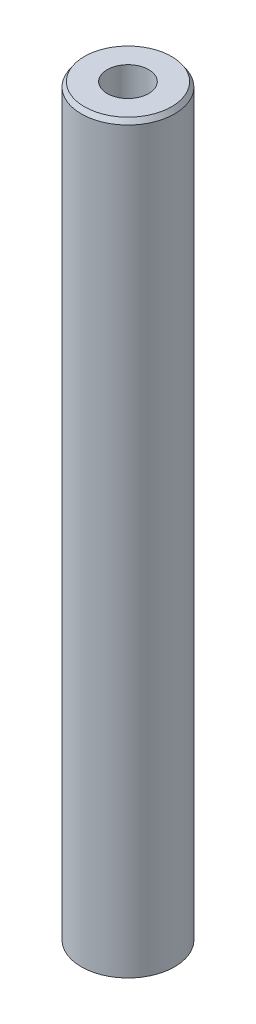
ISO-10303-21;
HEADER;
FILE_DESCRIPTION(('STEP AP214'),'2;1');
FILE_NAME('part.step','',(''),(''),'','','');
FILE_SCHEMA(('AUTOMOTIVE_DESIGN { 1 0 10303 214 1 1 1 1 }'));
ENDSEC;
DATA;
#1=APPLICATION_CONTEXT('core data for automotive mechanical design processes');
#2=APPLICATION_PROTOCOL_DEFINITION('international standard','automotive_design',2000,#1);
#3=PRODUCT_CONTEXT('',#1,'mechanical');
#4=PRODUCT('Part','Part','',(#3));
#5=PRODUCT_RELATED_PRODUCT_CATEGORY('part','',(#4));
#6=PRODUCT_DEFINITION_FORMATION('','',#4);
#7=PRODUCT_DEFINITION_CONTEXT('part definition',#1,'design');
#8=PRODUCT_DEFINITION('design','',#6,#7);
#9=PRODUCT_DEFINITION_SHAPE('','',#8);
#10=(LENGTH_UNIT() NAMED_UNIT(*) SI_UNIT(.MILLI.,.METRE.));
#11=(NAMED_UNIT(*) PLANE_ANGLE_UNIT() SI_UNIT($,.RADIAN.));
#12=(NAMED_UNIT(*) SI_UNIT($,.STERADIAN.) SOLID_ANGLE_UNIT());
#13=UNCERTAINTY_MEASURE_WITH_UNIT(LENGTH_MEASURE(1.E-05),#10,'distance_accuracy_value','');
#14=(GEOMETRIC_REPRESENTATION_CONTEXT(3) GLOBAL_UNCERTAINTY_ASSIGNED_CONTEXT((#13)) GLOBAL_UNIT_ASSIGNED_CONTEXT((#10,
#11,#12)) REPRESENTATION_CONTEXT('',''));
#15=CARTESIAN_POINT('',(0.,0.,0.));
#16=DIRECTION('',(0.,0.,1.));
#17=DIRECTION('',(1.,0.,0.));
#18=AXIS2_PLACEMENT_3D('',#15,#16,#17);
#19=CARTESIAN_POINT('',(0.,600.,0.));
#20=DIRECTION('',(0.,-1.,0.));
#21=DIRECTION('',(0.,0.,-1.));
#22=AXIS2_PLACEMENT_3D('',#19,#20,#21);
#23=CYLINDRICAL_SURFACE('',#22,37.5);
#24=CARTESIAN_POINT('',(0.,596.244996890339,0.));
#25=DIRECTION('',(0.,1.,0.));
#26=DIRECTION('',(0.,0.,1.));
#27=AXIS2_PLACEMENT_3D('',#24,#25,#26);
#28=CIRCLE('',#27,37.5);
#29=CARTESIAN_POINT('',(0.,596.244996890339,37.5));
#30=VERTEX_POINT('',#29);
#31=EDGE_CURVE('E50',#30,#30,#28,.F.);
#32=ORIENTED_EDGE('',*,*,#31,.T.);
#33=EDGE_LOOP('',(#32));
#34=FACE_BOUND('',#33,.T.);
#35=CARTESIAN_POINT('',(0.,2.45607248550395,0.));
#36=DIRECTION('',(0.,1.,0.));
#37=DIRECTION('',(0.,0.,1.));
#38=AXIS2_PLACEMENT_3D('',#35,#36,#37);
#39=CIRCLE('',#38,37.5);
#40=CARTESIAN_POINT('',(0.,2.45607248550395,37.5));
#41=VERTEX_POINT('',#40);
#42=EDGE_CURVE('E51',#41,#41,#39,.T.);
#43=ORIENTED_EDGE('',*,*,#42,.T.);
#44=EDGE_LOOP('',(#43));
#45=FACE_BOUND('',#44,.T.);
#46=ADVANCED_FACE('F39',(#34,#45),#23,.T.);
#47=CARTESIAN_POINT('',(0.,600.,0.));
#48=DIRECTION('',(0.,1.,0.));
#49=DIRECTION('',(0.,0.,1.));
#50=AXIS2_PLACEMENT_3D('',#47,#48,#49);
#51=PLANE('',#50);
#52=CARTESIAN_POINT('',(0.,600.,0.));
#53=DIRECTION('',(0.,1.,0.));
#54=DIRECTION('',(0.,0.,1.));
#55=AXIS2_PLACEMENT_3D('',#52,#53,#54);
#56=CIRCLE('',#55,35.0439275144959);
#57=CARTESIAN_POINT('',(0.,600.,35.0439275144959));
#58=VERTEX_POINT('',#57);
#59=EDGE_CURVE('E54',#58,#58,#56,.T.);
#60=ORIENTED_EDGE('',*,*,#59,.T.);
#61=EDGE_LOOP('',(#60));
#62=FACE_BOUND('',#61,.T.);
#63=CARTESIAN_POINT('',(0.,600.,0.));
#64=DIRECTION('',(0.,1.,0.));
#65=DIRECTION('',(0.,0.,1.));
#66=AXIS2_PLACEMENT_3D('',#63,#64,#65);
#67=CIRCLE('',#66,16.6763133244923);
#68=CARTESIAN_POINT('',(0.,600.,16.6763133244923));
#69=VERTEX_POINT('',#68);
#70=EDGE_CURVE('E58',#69,#69,#67,.T.);
#71=ORIENTED_EDGE('',*,*,#70,.F.);
#72=EDGE_LOOP('',(#71));
#73=FACE_BOUND('',#72,.T.);
#74=ADVANCED_FACE('F69',(#62,#73),#51,.T.);
#75=CARTESIAN_POINT('',(0.,0.,0.));
#76=DIRECTION('',(0.,1.,0.));
#77=DIRECTION('',(0.,0.,1.));
#78=AXIS2_PLACEMENT_3D('',#75,#76,#77);
#79=PLANE('',#78);
#80=CARTESIAN_POINT('',(0.,0.,0.));
#81=DIRECTION('',(0.,1.,0.));
#82=DIRECTION('',(0.,0.,1.));
#83=AXIS2_PLACEMENT_3D('',#80,#81,#82);
#84=CIRCLE('',#83,33.7449968903392);
#85=CARTESIAN_POINT('',(0.,0.,33.7449968903392));
#86=VERTEX_POINT('',#85);
#87=EDGE_CURVE('E10',#86,#86,#84,.F.);
#88=ORIENTED_EDGE('',*,*,#87,.T.);
#89=EDGE_LOOP('',(#88));
#90=FACE_BOUND('',#89,.T.);
#91=CARTESIAN_POINT('',(0.,0.,0.));
#92=DIRECTION('',(0.,1.,0.));
#93=DIRECTION('',(0.,0.,1.));
#94=AXIS2_PLACEMENT_3D('',#91,#92,#93);
#95=CIRCLE('',#94,16.6763133244923);
#96=CARTESIAN_POINT('',(0.,0.,16.6763133244923));
#97=VERTEX_POINT('',#96);
#98=EDGE_CURVE('E63',#97,#97,#95,.T.);
#99=ORIENTED_EDGE('',*,*,#98,.T.);
#100=EDGE_LOOP('',(#99));
#101=FACE_BOUND('',#100,.T.);
#102=ADVANCED_FACE('F75',(#90,#101),#79,.F.);
#103=CARTESIAN_POINT('',(0.,600.,0.));
#104=DIRECTION('',(0.,-1.,0.));
#105=DIRECTION('',(0.,0.,-1.));
#106=AXIS2_PLACEMENT_3D('',#103,#104,#105);
#107=CYLINDRICAL_SURFACE('',#106,16.6763133244923);
#108=ORIENTED_EDGE('',*,*,#70,.T.);
#109=EDGE_LOOP('',(#108));
#110=FACE_BOUND('',#109,.T.);
#111=ORIENTED_EDGE('',*,*,#98,.F.);
#112=EDGE_LOOP('',(#111));
#113=FACE_BOUND('',#112,.T.);
#114=ADVANCED_FACE('F70',(#110,#113),#107,.F.);
#115=CARTESIAN_POINT('',(0.,600.,0.));
#116=DIRECTION('',(0.,-1.,0.));
#117=DIRECTION('',(0.,0.,-1.));
#118=AXIS2_PLACEMENT_3D('',#115,#116,#117);
#119=CONICAL_SURFACE('',#118,35.0439275144959,0.579238074906256);
#120=ORIENTED_EDGE('',*,*,#31,.F.);
#121=EDGE_LOOP('',(#120));
#122=FACE_BOUND('',#121,.T.);
#123=ORIENTED_EDGE('',*,*,#59,.F.);
#124=EDGE_LOOP('',(#123));
#125=FACE_BOUND('',#124,.T.);
#126=ADVANCED_FACE('F81',(#122,#125),#119,.T.);
#127=CARTESIAN_POINT('',(0.,2.45607248550395,0.));
#128=DIRECTION('',(0.,1.,0.));
#129=DIRECTION('',(0.,0.,1.));
#130=AXIS2_PLACEMENT_3D('',#127,#128,#129);
#131=CONICAL_SURFACE('',#130,37.5,0.991558251888637);
#132=ORIENTED_EDGE('',*,*,#87,.F.);
#133=EDGE_LOOP('',(#132));
#134=FACE_BOUND('',#133,.T.);
#135=ORIENTED_EDGE('',*,*,#42,.F.);
#136=EDGE_LOOP('',(#135));
#137=FACE_BOUND('',#136,.T.);
#138=ADVANCED_FACE('F45',(#134,#137),#131,.T.);
#139=CLOSED_SHELL('',(#46,#74,#102,#114,#126,#138));
#140=MANIFOLD_SOLID_BREP('B2',#139);
#141=ADVANCED_BREP_SHAPE_REPRESENTATION('',(#18,#140),#14);
#142=SHAPE_DEFINITION_REPRESENTATION(#9,#141);
ENDSEC;
END-ISO-10303-21;
